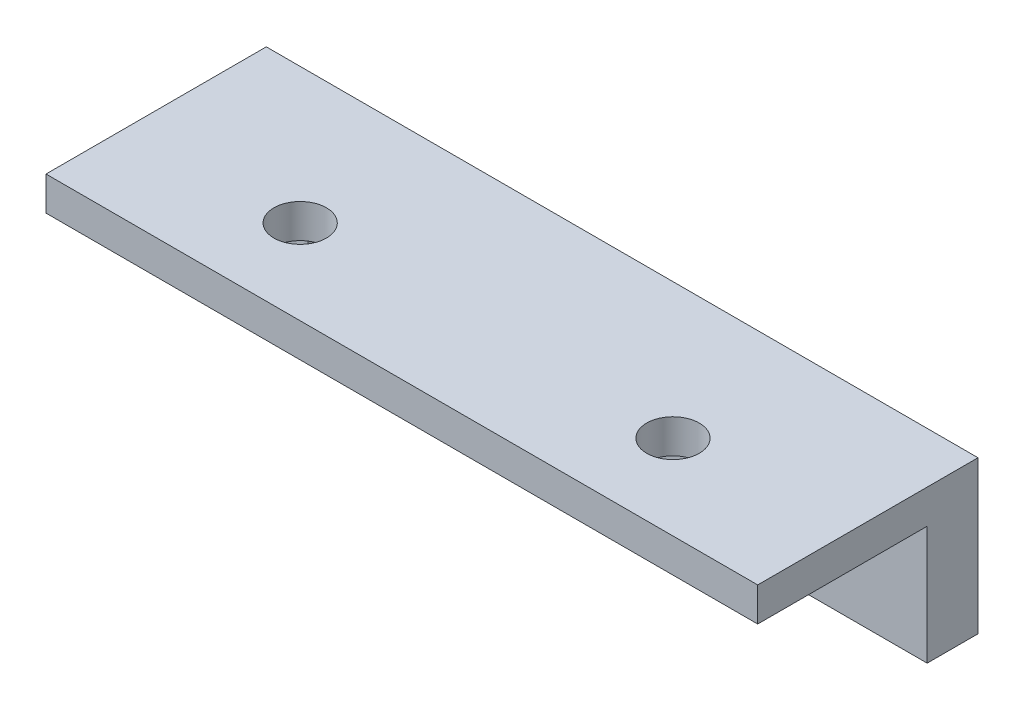
ISO-10303-21;
HEADER;
FILE_DESCRIPTION(('STEP AP214'),'2;1');
FILE_NAME('part.step','',(''),(''),'','','');
FILE_SCHEMA(('AUTOMOTIVE_DESIGN { 1 0 10303 214 1 1 1 1 }'));
ENDSEC;
DATA;
#1=APPLICATION_CONTEXT('core data for automotive mechanical design processes');
#2=APPLICATION_PROTOCOL_DEFINITION('international standard','automotive_design',2000,#1);
#3=PRODUCT_CONTEXT('',#1,'mechanical');
#4=PRODUCT('Part','Part','',(#3));
#5=PRODUCT_RELATED_PRODUCT_CATEGORY('part','',(#4));
#6=PRODUCT_DEFINITION_FORMATION('','',#4);
#7=PRODUCT_DEFINITION_CONTEXT('part definition',#1,'design');
#8=PRODUCT_DEFINITION('design','',#6,#7);
#9=PRODUCT_DEFINITION_SHAPE('','',#8);
#10=(LENGTH_UNIT() NAMED_UNIT(*) SI_UNIT(.MILLI.,.METRE.));
#11=(NAMED_UNIT(*) PLANE_ANGLE_UNIT() SI_UNIT($,.RADIAN.));
#12=(NAMED_UNIT(*) SI_UNIT($,.STERADIAN.) SOLID_ANGLE_UNIT());
#13=UNCERTAINTY_MEASURE_WITH_UNIT(LENGTH_MEASURE(1.E-05),#10,'distance_accuracy_value','');
#14=(GEOMETRIC_REPRESENTATION_CONTEXT(3) GLOBAL_UNCERTAINTY_ASSIGNED_CONTEXT((#13)) GLOBAL_UNIT_ASSIGNED_CONTEXT((#10,
#11,#12)) REPRESENTATION_CONTEXT('',''));
#15=CARTESIAN_POINT('',(0.,0.,0.));
#16=DIRECTION('',(0.,0.,1.));
#17=DIRECTION('',(1.,0.,0.));
#18=AXIS2_PLACEMENT_3D('',#15,#16,#17);
#19=CARTESIAN_POINT('',(0.,5.,3.));
#20=DIRECTION('',(0.,1.,0.));
#21=DIRECTION('',(0.,0.,1.));
#22=AXIS2_PLACEMENT_3D('',#19,#20,#21);
#23=PLANE('',#22);
#24=DIRECTION('',(1.,0.,0.));
#25=VECTOR('',#24,1.);
#26=CARTESIAN_POINT('',(0.,5.,0.));
#27=LINE('',#26,#25);
#28=CARTESIAN_POINT('',(5.,5.,0.));
#29=VERTEX_POINT('',#28);
#30=CARTESIAN_POINT('',(47.,5.,0.));
#31=VERTEX_POINT('',#30);
#32=EDGE_CURVE('E104',#29,#31,#27,.T.);
#33=ORIENTED_EDGE('',*,*,#32,.T.);
#34=DIRECTION('',(0.,0.,-1.));
#35=VECTOR('',#34,1.);
#36=CARTESIAN_POINT('',(47.,5.,3.));
#37=LINE('',#36,#35);
#38=CARTESIAN_POINT('',(47.,5.,3.));
#39=VERTEX_POINT('',#38);
#40=EDGE_CURVE('E11',#39,#31,#37,.T.);
#41=ORIENTED_EDGE('',*,*,#40,.F.);
#42=DIRECTION('',(1.,0.,0.));
#43=VECTOR('',#42,1.);
#44=CARTESIAN_POINT('',(0.,5.,3.));
#45=LINE('',#44,#43);
#46=CARTESIAN_POINT('',(5.,5.,3.));
#47=VERTEX_POINT('',#46);
#48=EDGE_CURVE('E95',#47,#39,#45,.T.);
#49=ORIENTED_EDGE('',*,*,#48,.F.);
#50=DIRECTION('',(0.,0.,-1.));
#51=VECTOR('',#50,1.);
#52=CARTESIAN_POINT('',(5.,5.,3.));
#53=LINE('',#52,#51);
#54=EDGE_CURVE('E50',#47,#29,#53,.T.);
#55=ORIENTED_EDGE('',*,*,#54,.T.);
#56=EDGE_LOOP('',(#33,#41,#49,#55));
#57=FACE_BOUND('',#56,.T.);
#58=ADVANCED_FACE('F40',(#57),#23,.F.);
#59=CARTESIAN_POINT('',(47.,0.,3.));
#60=DIRECTION('',(-1.,0.,0.));
#61=DIRECTION('',(0.,-1.,0.));
#62=AXIS2_PLACEMENT_3D('',#59,#60,#61);
#63=PLANE('',#62);
#64=DIRECTION('',(0.,1.,0.));
#65=VECTOR('',#64,1.);
#66=CARTESIAN_POINT('',(47.,0.,0.));
#67=LINE('',#66,#65);
#68=CARTESIAN_POINT('',(47.,14.,0.));
#69=VERTEX_POINT('',#68);
#70=EDGE_CURVE('E70',#31,#69,#67,.T.);
#71=ORIENTED_EDGE('',*,*,#70,.T.);
#72=DIRECTION('',(0.,0.,-1.));
#73=VECTOR('',#72,1.);
#74=CARTESIAN_POINT('',(47.,14.,13.));
#75=LINE('',#74,#73);
#76=CARTESIAN_POINT('',(47.,14.,13.));
#77=VERTEX_POINT('',#76);
#78=EDGE_CURVE('E131',#77,#69,#75,.T.);
#79=ORIENTED_EDGE('',*,*,#78,.F.);
#80=DIRECTION('',(0.,1.,0.));
#81=VECTOR('',#80,1.);
#82=CARTESIAN_POINT('',(47.,0.,13.));
#83=LINE('',#82,#81);
#84=CARTESIAN_POINT('',(47.,12.,13.));
#85=VERTEX_POINT('',#84);
#86=EDGE_CURVE('E271',#85,#77,#83,.T.);
#87=ORIENTED_EDGE('',*,*,#86,.F.);
#88=DIRECTION('',(0.,0.,-1.));
#89=VECTOR('',#88,1.);
#90=CARTESIAN_POINT('',(47.,12.,13.));
#91=LINE('',#90,#89);
#92=CARTESIAN_POINT('',(47.,12.,3.));
#93=VERTEX_POINT('',#92);
#94=EDGE_CURVE('E92',#85,#93,#91,.T.);
#95=ORIENTED_EDGE('',*,*,#94,.T.);
#96=DIRECTION('',(0.,1.,0.));
#97=VECTOR('',#96,1.);
#98=CARTESIAN_POINT('',(47.,0.,3.));
#99=LINE('',#98,#97);
#100=EDGE_CURVE('E77',#39,#93,#99,.T.);
#101=ORIENTED_EDGE('',*,*,#100,.F.);
#102=ORIENTED_EDGE('',*,*,#40,.T.);
#103=EDGE_LOOP('',(#71,#79,#87,#95,#101,#102));
#104=FACE_BOUND('',#103,.T.);
#105=ADVANCED_FACE('F87',(#104),#63,.F.);
#106=CARTESIAN_POINT('',(40.,8.4,3.));
#107=DIRECTION('',(0.,0.,-1.));
#108=DIRECTION('',(-1.,0.,0.));
#109=AXIS2_PLACEMENT_3D('',#106,#107,#108);
#110=CYLINDRICAL_SURFACE('',#109,1.55);
#111=CARTESIAN_POINT('',(40.,8.4,3.));
#112=DIRECTION('',(0.,0.,1.));
#113=DIRECTION('',(1.,0.,0.));
#114=AXIS2_PLACEMENT_3D('',#111,#112,#113);
#115=CIRCLE('',#114,1.55);
#116=CARTESIAN_POINT('',(41.55,8.4,3.));
#117=VERTEX_POINT('',#116);
#118=EDGE_CURVE('E102',#117,#117,#115,.T.);
#119=ORIENTED_EDGE('',*,*,#118,.T.);
#120=EDGE_LOOP('',(#119));
#121=FACE_BOUND('',#120,.T.);
#122=CARTESIAN_POINT('',(40.,8.4,0.));
#123=DIRECTION('',(0.,0.,1.));
#124=DIRECTION('',(1.,0.,0.));
#125=AXIS2_PLACEMENT_3D('',#122,#123,#124);
#126=CIRCLE('',#125,1.55);
#127=CARTESIAN_POINT('',(41.55,8.4,0.));
#128=VERTEX_POINT('',#127);
#129=EDGE_CURVE('E107',#128,#128,#126,.T.);
#130=ORIENTED_EDGE('',*,*,#129,.F.);
#131=EDGE_LOOP('',(#130));
#132=FACE_BOUND('',#131,.T.);
#133=ADVANCED_FACE('F146',(#121,#132),#110,.F.);
#134=CARTESIAN_POINT('',(12.,8.4,3.));
#135=DIRECTION('',(0.,0.,-1.));
#136=DIRECTION('',(-1.,0.,0.));
#137=AXIS2_PLACEMENT_3D('',#134,#135,#136);
#138=CYLINDRICAL_SURFACE('',#137,1.55);
#139=CARTESIAN_POINT('',(12.,8.4,3.));
#140=DIRECTION('',(0.,0.,1.));
#141=DIRECTION('',(1.,0.,0.));
#142=AXIS2_PLACEMENT_3D('',#139,#140,#141);
#143=CIRCLE('',#142,1.55);
#144=CARTESIAN_POINT('',(13.55,8.4,3.));
#145=VERTEX_POINT('',#144);
#146=EDGE_CURVE('E119',#145,#145,#143,.T.);
#147=ORIENTED_EDGE('',*,*,#146,.T.);
#148=EDGE_LOOP('',(#147));
#149=FACE_BOUND('',#148,.T.);
#150=CARTESIAN_POINT('',(12.,8.4,0.));
#151=DIRECTION('',(0.,0.,1.));
#152=DIRECTION('',(1.,0.,0.));
#153=AXIS2_PLACEMENT_3D('',#150,#151,#152);
#154=CIRCLE('',#153,1.55);
#155=CARTESIAN_POINT('',(13.55,8.4,0.));
#156=VERTEX_POINT('',#155);
#157=EDGE_CURVE('E114',#156,#156,#154,.T.);
#158=ORIENTED_EDGE('',*,*,#157,.F.);
#159=EDGE_LOOP('',(#158));
#160=FACE_BOUND('',#159,.T.);
#161=ADVANCED_FACE('F42',(#149,#160),#138,.F.);
#162=CARTESIAN_POINT('',(5.,0.,3.));
#163=DIRECTION('',(-1.,0.,0.));
#164=DIRECTION('',(0.,-1.,0.));
#165=AXIS2_PLACEMENT_3D('',#162,#163,#164);
#166=PLANE('',#165);
#167=DIRECTION('',(0.,1.,0.));
#168=VECTOR('',#167,1.);
#169=CARTESIAN_POINT('',(5.,0.,0.));
#170=LINE('',#169,#168);
#171=CARTESIAN_POINT('',(5.,14.,0.));
#172=VERTEX_POINT('',#171);
#173=EDGE_CURVE('E111',#29,#172,#170,.T.);
#174=ORIENTED_EDGE('',*,*,#173,.F.);
#175=ORIENTED_EDGE('',*,*,#54,.F.);
#176=DIRECTION('',(0.,1.,0.));
#177=VECTOR('',#176,1.);
#178=CARTESIAN_POINT('',(5.,0.,3.));
#179=LINE('',#178,#177);
#180=CARTESIAN_POINT('',(5.,12.,3.));
#181=VERTEX_POINT('',#180);
#182=EDGE_CURVE('E99',#47,#181,#179,.T.);
#183=ORIENTED_EDGE('',*,*,#182,.T.);
#184=DIRECTION('',(0.,0.,-1.));
#185=VECTOR('',#184,1.);
#186=CARTESIAN_POINT('',(5.,12.,13.));
#187=LINE('',#186,#185);
#188=CARTESIAN_POINT('',(5.,12.,13.));
#189=VERTEX_POINT('',#188);
#190=EDGE_CURVE('E282',#189,#181,#187,.T.);
#191=ORIENTED_EDGE('',*,*,#190,.F.);
#192=DIRECTION('',(0.,1.,0.));
#193=VECTOR('',#192,1.);
#194=CARTESIAN_POINT('',(5.,0.,13.));
#195=LINE('',#194,#193);
#196=CARTESIAN_POINT('',(5.,14.,13.));
#197=VERTEX_POINT('',#196);
#198=EDGE_CURVE('E279',#189,#197,#195,.T.);
#199=ORIENTED_EDGE('',*,*,#198,.T.);
#200=DIRECTION('',(0.,0.,-1.));
#201=VECTOR('',#200,1.);
#202=CARTESIAN_POINT('',(5.,14.,13.));
#203=LINE('',#202,#201);
#204=EDGE_CURVE('E135',#197,#172,#203,.T.);
#205=ORIENTED_EDGE('',*,*,#204,.T.);
#206=EDGE_LOOP('',(#174,#175,#183,#191,#199,#205));
#207=FACE_BOUND('',#206,.T.);
#208=ADVANCED_FACE('F151',(#207),#166,.T.);
#209=CARTESIAN_POINT('',(0.,0.,3.));
#210=DIRECTION('',(0.,0.,1.));
#211=DIRECTION('',(1.,0.,0.));
#212=AXIS2_PLACEMENT_3D('',#209,#210,#211);
#213=PLANE('',#212);
#214=ORIENTED_EDGE('',*,*,#146,.F.);
#215=EDGE_LOOP('',(#214));
#216=FACE_BOUND('',#215,.T.);
#217=ORIENTED_EDGE('',*,*,#118,.F.);
#218=EDGE_LOOP('',(#217));
#219=FACE_BOUND('',#218,.T.);
#220=ORIENTED_EDGE('',*,*,#48,.T.);
#221=ORIENTED_EDGE('',*,*,#100,.T.);
#222=DIRECTION('',(1.,0.,0.));
#223=VECTOR('',#222,1.);
#224=CARTESIAN_POINT('',(0.,12.,3.));
#225=LINE('',#224,#223);
#226=EDGE_CURVE('E94',#181,#93,#225,.T.);
#227=ORIENTED_EDGE('',*,*,#226,.F.);
#228=ORIENTED_EDGE('',*,*,#182,.F.);
#229=EDGE_LOOP('',(#220,#221,#227,#228));
#230=FACE_BOUND('',#229,.T.);
#231=ADVANCED_FACE('F98',(#216,#219,#230),#213,.T.);
#232=CARTESIAN_POINT('',(0.,0.,0.));
#233=DIRECTION('',(0.,0.,1.));
#234=DIRECTION('',(1.,0.,0.));
#235=AXIS2_PLACEMENT_3D('',#232,#233,#234);
#236=PLANE('',#235);
#237=ORIENTED_EDGE('',*,*,#157,.T.);
#238=EDGE_LOOP('',(#237));
#239=FACE_BOUND('',#238,.T.);
#240=ORIENTED_EDGE('',*,*,#129,.T.);
#241=EDGE_LOOP('',(#240));
#242=FACE_BOUND('',#241,.T.);
#243=ORIENTED_EDGE('',*,*,#32,.F.);
#244=ORIENTED_EDGE('',*,*,#173,.T.);
#245=DIRECTION('',(1.,0.,0.));
#246=VECTOR('',#245,1.);
#247=CARTESIAN_POINT('',(0.,14.,0.));
#248=LINE('',#247,#246);
#249=EDGE_CURVE('E257',#172,#69,#248,.T.);
#250=ORIENTED_EDGE('',*,*,#249,.T.);
#251=ORIENTED_EDGE('',*,*,#70,.F.);
#252=EDGE_LOOP('',(#243,#244,#250,#251));
#253=FACE_BOUND('',#252,.T.);
#254=ADVANCED_FACE('F150',(#239,#242,#253),#236,.F.);
#255=CARTESIAN_POINT('',(0.,12.,13.));
#256=DIRECTION('',(0.,1.,0.));
#257=DIRECTION('',(0.,0.,1.));
#258=AXIS2_PLACEMENT_3D('',#255,#256,#257);
#259=PLANE('',#258);
#260=CARTESIAN_POINT('',(15.,12.,8.));
#261=DIRECTION('',(0.,1.,0.));
#262=DIRECTION('',(0.,0.,1.));
#263=AXIS2_PLACEMENT_3D('',#260,#261,#262);
#264=CIRCLE('',#263,1.55);
#265=CARTESIAN_POINT('',(15.,12.,9.55));
#266=VERTEX_POINT('',#265);
#267=EDGE_CURVE('E255',#266,#266,#264,.T.);
#268=ORIENTED_EDGE('',*,*,#267,.T.);
#269=EDGE_LOOP('',(#268));
#270=FACE_BOUND('',#269,.T.);
#271=CARTESIAN_POINT('',(37.,12.,8.));
#272=DIRECTION('',(0.,1.,0.));
#273=DIRECTION('',(0.,0.,1.));
#274=AXIS2_PLACEMENT_3D('',#271,#272,#273);
#275=CIRCLE('',#274,1.55);
#276=CARTESIAN_POINT('',(37.,12.,9.55));
#277=VERTEX_POINT('',#276);
#278=EDGE_CURVE('E258',#277,#277,#275,.T.);
#279=ORIENTED_EDGE('',*,*,#278,.T.);
#280=EDGE_LOOP('',(#279));
#281=FACE_BOUND('',#280,.T.);
#282=ORIENTED_EDGE('',*,*,#190,.T.);
#283=ORIENTED_EDGE('',*,*,#226,.T.);
#284=ORIENTED_EDGE('',*,*,#94,.F.);
#285=DIRECTION('',(1.,0.,0.));
#286=VECTOR('',#285,1.);
#287=CARTESIAN_POINT('',(0.,12.,13.));
#288=LINE('',#287,#286);
#289=EDGE_CURVE('E262',#189,#85,#288,.T.);
#290=ORIENTED_EDGE('',*,*,#289,.F.);
#291=EDGE_LOOP('',(#282,#283,#284,#290));
#292=FACE_BOUND('',#291,.T.);
#293=ADVANCED_FACE('F158',(#270,#281,#292),#259,.F.);
#294=CARTESIAN_POINT('',(0.,14.,13.));
#295=DIRECTION('',(0.,1.,0.));
#296=DIRECTION('',(0.,0.,1.));
#297=AXIS2_PLACEMENT_3D('',#294,#295,#296);
#298=PLANE('',#297);
#299=CARTESIAN_POINT('',(15.,14.,8.));
#300=DIRECTION('',(0.,1.,0.));
#301=DIRECTION('',(0.,0.,1.));
#302=AXIS2_PLACEMENT_3D('',#299,#300,#301);
#303=CIRCLE('',#302,1.55);
#304=CARTESIAN_POINT('',(15.,14.,9.55));
#305=VERTEX_POINT('',#304);
#306=EDGE_CURVE('E252',#305,#305,#303,.T.);
#307=ORIENTED_EDGE('',*,*,#306,.F.);
#308=EDGE_LOOP('',(#307));
#309=FACE_BOUND('',#308,.T.);
#310=CARTESIAN_POINT('',(37.,14.,8.));
#311=DIRECTION('',(0.,1.,0.));
#312=DIRECTION('',(0.,0.,1.));
#313=AXIS2_PLACEMENT_3D('',#310,#311,#312);
#314=CIRCLE('',#313,1.55);
#315=CARTESIAN_POINT('',(37.,14.,9.55));
#316=VERTEX_POINT('',#315);
#317=EDGE_CURVE('E301',#316,#316,#314,.T.);
#318=ORIENTED_EDGE('',*,*,#317,.F.);
#319=EDGE_LOOP('',(#318));
#320=FACE_BOUND('',#319,.T.);
#321=ORIENTED_EDGE('',*,*,#249,.F.);
#322=ORIENTED_EDGE('',*,*,#204,.F.);
#323=DIRECTION('',(1.,0.,0.));
#324=VECTOR('',#323,1.);
#325=CARTESIAN_POINT('',(0.,14.,13.));
#326=LINE('',#325,#324);
#327=EDGE_CURVE('E275',#197,#77,#326,.T.);
#328=ORIENTED_EDGE('',*,*,#327,.T.);
#329=ORIENTED_EDGE('',*,*,#78,.T.);
#330=EDGE_LOOP('',(#321,#322,#328,#329));
#331=FACE_BOUND('',#330,.T.);
#332=ADVANCED_FACE('F209',(#309,#320,#331),#298,.T.);
#333=CARTESIAN_POINT('',(0.,0.,13.));
#334=DIRECTION('',(0.,0.,1.));
#335=DIRECTION('',(1.,0.,0.));
#336=AXIS2_PLACEMENT_3D('',#333,#334,#335);
#337=PLANE('',#336);
#338=ORIENTED_EDGE('',*,*,#289,.T.);
#339=ORIENTED_EDGE('',*,*,#86,.T.);
#340=ORIENTED_EDGE('',*,*,#327,.F.);
#341=ORIENTED_EDGE('',*,*,#198,.F.);
#342=EDGE_LOOP('',(#338,#339,#340,#341));
#343=FACE_BOUND('',#342,.T.);
#344=ADVANCED_FACE('F203',(#343),#337,.T.);
#345=CARTESIAN_POINT('',(37.,0.999999999999999,8.));
#346=DIRECTION('',(0.,1.,0.));
#347=DIRECTION('',(0.,0.,1.));
#348=AXIS2_PLACEMENT_3D('',#345,#346,#347);
#349=CYLINDRICAL_SURFACE('',#348,1.55);
#350=ORIENTED_EDGE('',*,*,#317,.T.);
#351=EDGE_LOOP('',(#350));
#352=FACE_BOUND('',#351,.T.);
#353=ORIENTED_EDGE('',*,*,#278,.F.);
#354=EDGE_LOOP('',(#353));
#355=FACE_BOUND('',#354,.T.);
#356=ADVANCED_FACE('F208',(#352,#355),#349,.F.);
#357=CARTESIAN_POINT('',(15.,0.999999999999999,8.));
#358=DIRECTION('',(0.,1.,0.));
#359=DIRECTION('',(0.,0.,1.));
#360=AXIS2_PLACEMENT_3D('',#357,#358,#359);
#361=CYLINDRICAL_SURFACE('',#360,1.55);
#362=ORIENTED_EDGE('',*,*,#306,.T.);
#363=EDGE_LOOP('',(#362));
#364=FACE_BOUND('',#363,.T.);
#365=ORIENTED_EDGE('',*,*,#267,.F.);
#366=EDGE_LOOP('',(#365));
#367=FACE_BOUND('',#366,.T.);
#368=ADVANCED_FACE('F235',(#364,#367),#361,.F.);
#369=CLOSED_SHELL('',(#58,#105,#133,#161,#208,#231,#254,#293,#332,#344,#356,#368));
#370=MANIFOLD_SOLID_BREP('B2',#369);
#371=ADVANCED_BREP_SHAPE_REPRESENTATION('',(#18,#370),#14);
#372=SHAPE_DEFINITION_REPRESENTATION(#9,#371);
ENDSEC;
END-ISO-10303-21;
